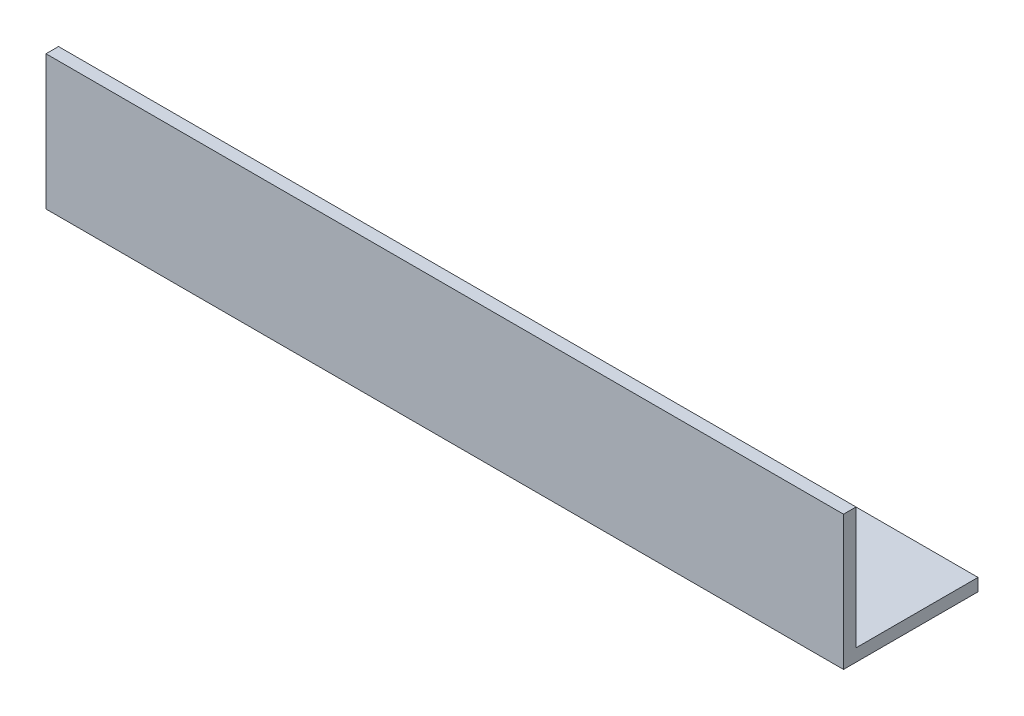
ISO-10303-21;
HEADER;
FILE_DESCRIPTION(('STEP AP214'),'2;1');
FILE_NAME('part.step','',(''),(''),'','','');
FILE_SCHEMA(('AUTOMOTIVE_DESIGN { 1 0 10303 214 1 1 1 1 }'));
ENDSEC;
DATA;
#1=APPLICATION_CONTEXT('core data for automotive mechanical design processes');
#2=APPLICATION_PROTOCOL_DEFINITION('international standard','automotive_design',2000,#1);
#3=PRODUCT_CONTEXT('',#1,'mechanical');
#4=PRODUCT('Part','Part','',(#3));
#5=PRODUCT_RELATED_PRODUCT_CATEGORY('part','',(#4));
#6=PRODUCT_DEFINITION_FORMATION('','',#4);
#7=PRODUCT_DEFINITION_CONTEXT('part definition',#1,'design');
#8=PRODUCT_DEFINITION('design','',#6,#7);
#9=PRODUCT_DEFINITION_SHAPE('','',#8);
#10=(LENGTH_UNIT() NAMED_UNIT(*) SI_UNIT(.MILLI.,.METRE.));
#11=(NAMED_UNIT(*) PLANE_ANGLE_UNIT() SI_UNIT($,.RADIAN.));
#12=(NAMED_UNIT(*) SI_UNIT($,.STERADIAN.) SOLID_ANGLE_UNIT());
#13=UNCERTAINTY_MEASURE_WITH_UNIT(LENGTH_MEASURE(1.E-05),#10,'distance_accuracy_value','');
#14=(GEOMETRIC_REPRESENTATION_CONTEXT(3) GLOBAL_UNCERTAINTY_ASSIGNED_CONTEXT((#13)) GLOBAL_UNIT_ASSIGNED_CONTEXT((#10,
#11,#12)) REPRESENTATION_CONTEXT('',''));
#15=CARTESIAN_POINT('',(0.,0.,0.));
#16=DIRECTION('',(0.,0.,1.));
#17=DIRECTION('',(1.,0.,0.));
#18=AXIS2_PLACEMENT_3D('',#15,#16,#17);
#19=CARTESIAN_POINT('',(255.,0.,0.));
#20=DIRECTION('',(0.,1.,0.));
#21=DIRECTION('',(0.,0.,1.));
#22=AXIS2_PLACEMENT_3D('',#19,#20,#21);
#23=PLANE('',#22);
#24=CARTESIAN_POINT('',(180.,0.,-23.));
#25=DIRECTION('',(0.,-1.,0.));
#26=DIRECTION('',(0.,0.,-1.));
#27=AXIS2_PLACEMENT_3D('',#24,#25,#26);
#28=CIRCLE('',#27,4.99999999999999);
#29=CARTESIAN_POINT('',(180.,0.,-28.));
#30=VERTEX_POINT('',#29);
#31=EDGE_CURVE('E143',#30,#30,#28,.T.);
#32=ORIENTED_EDGE('',*,*,#31,.F.);
#33=EDGE_LOOP('',(#32));
#34=FACE_BOUND('',#33,.T.);
#35=CARTESIAN_POINT('',(80.,0.,-23.));
#36=DIRECTION('',(0.,-1.,0.));
#37=DIRECTION('',(0.,0.,-1.));
#38=AXIS2_PLACEMENT_3D('',#35,#36,#37);
#39=CIRCLE('',#38,5.);
#40=CARTESIAN_POINT('',(80.,0.,-28.));
#41=VERTEX_POINT('',#40);
#42=EDGE_CURVE('E135',#41,#41,#39,.T.);
#43=ORIENTED_EDGE('',*,*,#42,.F.);
#44=EDGE_LOOP('',(#43));
#45=FACE_BOUND('',#44,.T.);
#46=DIRECTION('',(0.,0.,-1.));
#47=VECTOR('',#46,1.);
#48=CARTESIAN_POINT('',(0.,0.,0.));
#49=LINE('',#48,#47);
#50=CARTESIAN_POINT('',(0.,0.,0.));
#51=VERTEX_POINT('',#50);
#52=CARTESIAN_POINT('',(0.,0.,-43.));
#53=VERTEX_POINT('',#52);
#54=EDGE_CURVE('E117',#51,#53,#49,.T.);
#55=ORIENTED_EDGE('',*,*,#54,.T.);
#56=DIRECTION('',(-1.,0.,0.));
#57=VECTOR('',#56,1.);
#58=CARTESIAN_POINT('',(255.,0.,-43.));
#59=LINE('',#58,#57);
#60=CARTESIAN_POINT('',(255.,0.,-43.));
#61=VERTEX_POINT('',#60);
#62=EDGE_CURVE('E11',#61,#53,#59,.T.);
#63=ORIENTED_EDGE('',*,*,#62,.F.);
#64=DIRECTION('',(0.,0.,-1.));
#65=VECTOR('',#64,1.);
#66=CARTESIAN_POINT('',(255.,0.,0.));
#67=LINE('',#66,#65);
#68=CARTESIAN_POINT('',(255.,0.,0.));
#69=VERTEX_POINT('',#68);
#70=EDGE_CURVE('E82',#69,#61,#67,.T.);
#71=ORIENTED_EDGE('',*,*,#70,.F.);
#72=DIRECTION('',(-1.,0.,0.));
#73=VECTOR('',#72,1.);
#74=CARTESIAN_POINT('',(255.,0.,0.));
#75=LINE('',#74,#73);
#76=EDGE_CURVE('E113',#69,#51,#75,.T.);
#77=ORIENTED_EDGE('',*,*,#76,.T.);
#78=EDGE_LOOP('',(#55,#63,#71,#77));
#79=FACE_BOUND('',#78,.T.);
#80=ADVANCED_FACE('F34',(#34,#45,#79),#23,.F.);
#81=CARTESIAN_POINT('',(255.,4.,-43.));
#82=DIRECTION('',(0.,0.,-1.));
#83=DIRECTION('',(-1.,0.,0.));
#84=AXIS2_PLACEMENT_3D('',#81,#82,#83);
#85=PLANE('',#84);
#86=DIRECTION('',(0.,-1.,0.));
#87=VECTOR('',#86,1.);
#88=CARTESIAN_POINT('',(0.,4.,-43.));
#89=LINE('',#88,#87);
#90=CARTESIAN_POINT('',(0.,4.,-43.));
#91=VERTEX_POINT('',#90);
#92=EDGE_CURVE('E120',#91,#53,#89,.T.);
#93=ORIENTED_EDGE('',*,*,#92,.F.);
#94=DIRECTION('',(-1.,0.,0.));
#95=VECTOR('',#94,1.);
#96=CARTESIAN_POINT('',(255.,4.,-43.));
#97=LINE('',#96,#95);
#98=CARTESIAN_POINT('',(255.,4.,-43.));
#99=VERTEX_POINT('',#98);
#100=EDGE_CURVE('E43',#99,#91,#97,.T.);
#101=ORIENTED_EDGE('',*,*,#100,.F.);
#102=DIRECTION('',(0.,-1.,0.));
#103=VECTOR('',#102,1.);
#104=CARTESIAN_POINT('',(255.,4.,-43.));
#105=LINE('',#104,#103);
#106=EDGE_CURVE('E147',#99,#61,#105,.T.);
#107=ORIENTED_EDGE('',*,*,#106,.T.);
#108=ORIENTED_EDGE('',*,*,#62,.T.);
#109=EDGE_LOOP('',(#93,#101,#107,#108));
#110=FACE_BOUND('',#109,.T.);
#111=ADVANCED_FACE('F168',(#110),#85,.T.);
#112=CARTESIAN_POINT('',(255.,4.,0.));
#113=DIRECTION('',(0.,1.,0.));
#114=DIRECTION('',(0.,0.,1.));
#115=AXIS2_PLACEMENT_3D('',#112,#113,#114);
#116=PLANE('',#115);
#117=CARTESIAN_POINT('',(180.,4.,-23.));
#118=DIRECTION('',(0.,1.,0.));
#119=DIRECTION('',(0.,0.,1.));
#120=AXIS2_PLACEMENT_3D('',#117,#118,#119);
#121=CIRCLE('',#120,4.99999999999999);
#122=CARTESIAN_POINT('',(180.,4.,-18.));
#123=VERTEX_POINT('',#122);
#124=EDGE_CURVE('E37',#123,#123,#121,.T.);
#125=ORIENTED_EDGE('',*,*,#124,.F.);
#126=EDGE_LOOP('',(#125));
#127=FACE_BOUND('',#126,.T.);
#128=CARTESIAN_POINT('',(80.,4.,-23.));
#129=DIRECTION('',(0.,1.,0.));
#130=DIRECTION('',(0.,0.,1.));
#131=AXIS2_PLACEMENT_3D('',#128,#129,#130);
#132=CIRCLE('',#131,5.);
#133=CARTESIAN_POINT('',(80.,4.,-18.));
#134=VERTEX_POINT('',#133);
#135=EDGE_CURVE('E121',#134,#134,#132,.T.);
#136=ORIENTED_EDGE('',*,*,#135,.F.);
#137=EDGE_LOOP('',(#136));
#138=FACE_BOUND('',#137,.T.);
#139=DIRECTION('',(0.,0.,-1.));
#140=VECTOR('',#139,1.);
#141=CARTESIAN_POINT('',(0.,4.,0.));
#142=LINE('',#141,#140);
#143=CARTESIAN_POINT('',(0.,4.,-4.));
#144=VERTEX_POINT('',#143);
#145=EDGE_CURVE('E124',#144,#91,#142,.T.);
#146=ORIENTED_EDGE('',*,*,#145,.F.);
#147=DIRECTION('',(-1.,0.,0.));
#148=VECTOR('',#147,1.);
#149=CARTESIAN_POINT('',(255.,4.,-4.));
#150=LINE('',#149,#148);
#151=CARTESIAN_POINT('',(255.,4.,-4.));
#152=VERTEX_POINT('',#151);
#153=EDGE_CURVE('E103',#152,#144,#150,.T.);
#154=ORIENTED_EDGE('',*,*,#153,.F.);
#155=DIRECTION('',(0.,0.,-1.));
#156=VECTOR('',#155,1.);
#157=CARTESIAN_POINT('',(255.,4.,0.));
#158=LINE('',#157,#156);
#159=EDGE_CURVE('E109',#152,#99,#158,.T.);
#160=ORIENTED_EDGE('',*,*,#159,.T.);
#161=ORIENTED_EDGE('',*,*,#100,.T.);
#162=EDGE_LOOP('',(#146,#154,#160,#161));
#163=FACE_BOUND('',#162,.T.);
#164=ADVANCED_FACE('F151',(#127,#138,#163),#116,.T.);
#165=CARTESIAN_POINT('',(255.,43.,-4.));
#166=DIRECTION('',(0.,0.,-1.));
#167=DIRECTION('',(0.,1.,0.));
#168=AXIS2_PLACEMENT_3D('',#165,#166,#167);
#169=PLANE('',#168);
#170=DIRECTION('',(0.,-1.,0.));
#171=VECTOR('',#170,1.);
#172=CARTESIAN_POINT('',(0.,43.,-4.));
#173=LINE('',#172,#171);
#174=CARTESIAN_POINT('',(0.,43.,-4.));
#175=VERTEX_POINT('',#174);
#176=EDGE_CURVE('E98',#175,#144,#173,.T.);
#177=ORIENTED_EDGE('',*,*,#176,.F.);
#178=DIRECTION('',(-1.,0.,0.));
#179=VECTOR('',#178,1.);
#180=CARTESIAN_POINT('',(255.,43.,-4.));
#181=LINE('',#180,#179);
#182=CARTESIAN_POINT('',(255.,43.,-4.));
#183=VERTEX_POINT('',#182);
#184=EDGE_CURVE('E93',#183,#175,#181,.T.);
#185=ORIENTED_EDGE('',*,*,#184,.F.);
#186=DIRECTION('',(0.,-1.,0.));
#187=VECTOR('',#186,1.);
#188=CARTESIAN_POINT('',(255.,43.,-4.));
#189=LINE('',#188,#187);
#190=EDGE_CURVE('E96',#183,#152,#189,.T.);
#191=ORIENTED_EDGE('',*,*,#190,.T.);
#192=ORIENTED_EDGE('',*,*,#153,.T.);
#193=EDGE_LOOP('',(#177,#185,#191,#192));
#194=FACE_BOUND('',#193,.T.);
#195=ADVANCED_FACE('F95',(#194),#169,.T.);
#196=CARTESIAN_POINT('',(255.,43.,0.));
#197=DIRECTION('',(0.,1.,0.));
#198=DIRECTION('',(0.,0.,1.));
#199=AXIS2_PLACEMENT_3D('',#196,#197,#198);
#200=PLANE('',#199);
#201=DIRECTION('',(0.,0.,-1.));
#202=VECTOR('',#201,1.);
#203=CARTESIAN_POINT('',(0.,43.,0.));
#204=LINE('',#203,#202);
#205=CARTESIAN_POINT('',(0.,43.,0.));
#206=VERTEX_POINT('',#205);
#207=EDGE_CURVE('E128',#206,#175,#204,.T.);
#208=ORIENTED_EDGE('',*,*,#207,.F.);
#209=DIRECTION('',(-1.,0.,0.));
#210=VECTOR('',#209,1.);
#211=CARTESIAN_POINT('',(255.,43.,0.));
#212=LINE('',#211,#210);
#213=CARTESIAN_POINT('',(255.,43.,0.));
#214=VERTEX_POINT('',#213);
#215=EDGE_CURVE('E73',#214,#206,#212,.T.);
#216=ORIENTED_EDGE('',*,*,#215,.F.);
#217=DIRECTION('',(0.,0.,-1.));
#218=VECTOR('',#217,1.);
#219=CARTESIAN_POINT('',(255.,43.,0.));
#220=LINE('',#219,#218);
#221=EDGE_CURVE('E107',#214,#183,#220,.T.);
#222=ORIENTED_EDGE('',*,*,#221,.T.);
#223=ORIENTED_EDGE('',*,*,#184,.T.);
#224=EDGE_LOOP('',(#208,#216,#222,#223));
#225=FACE_BOUND('',#224,.T.);
#226=ADVANCED_FACE('F111',(#225),#200,.T.);
#227=CARTESIAN_POINT('',(255.,43.,0.));
#228=DIRECTION('',(0.,0.,-1.));
#229=DIRECTION('',(0.,1.,0.));
#230=AXIS2_PLACEMENT_3D('',#227,#228,#229);
#231=PLANE('',#230);
#232=DIRECTION('',(0.,-1.,0.));
#233=VECTOR('',#232,1.);
#234=CARTESIAN_POINT('',(0.,43.,0.));
#235=LINE('',#234,#233);
#236=EDGE_CURVE('E76',#206,#51,#235,.T.);
#237=ORIENTED_EDGE('',*,*,#236,.T.);
#238=ORIENTED_EDGE('',*,*,#76,.F.);
#239=DIRECTION('',(0.,-1.,0.));
#240=VECTOR('',#239,1.);
#241=CARTESIAN_POINT('',(255.,43.,0.));
#242=LINE('',#241,#240);
#243=EDGE_CURVE('E52',#214,#69,#242,.T.);
#244=ORIENTED_EDGE('',*,*,#243,.F.);
#245=ORIENTED_EDGE('',*,*,#215,.T.);
#246=EDGE_LOOP('',(#237,#238,#244,#245));
#247=FACE_BOUND('',#246,.T.);
#248=ADVANCED_FACE('F157',(#247),#231,.F.);
#249=CARTESIAN_POINT('',(255.,0.,0.));
#250=DIRECTION('',(-1.,0.,0.));
#251=DIRECTION('',(0.,0.,1.));
#252=AXIS2_PLACEMENT_3D('',#249,#250,#251);
#253=PLANE('',#252);
#254=ORIENTED_EDGE('',*,*,#70,.T.);
#255=ORIENTED_EDGE('',*,*,#106,.F.);
#256=ORIENTED_EDGE('',*,*,#159,.F.);
#257=ORIENTED_EDGE('',*,*,#190,.F.);
#258=ORIENTED_EDGE('',*,*,#221,.F.);
#259=ORIENTED_EDGE('',*,*,#243,.T.);
#260=EDGE_LOOP('',(#254,#255,#256,#257,#258,#259));
#261=FACE_BOUND('',#260,.T.);
#262=ADVANCED_FACE('F106',(#261),#253,.F.);
#263=CARTESIAN_POINT('',(0.,0.,0.));
#264=DIRECTION('',(-1.,0.,0.));
#265=DIRECTION('',(0.,0.,1.));
#266=AXIS2_PLACEMENT_3D('',#263,#264,#265);
#267=PLANE('',#266);
#268=ORIENTED_EDGE('',*,*,#54,.F.);
#269=ORIENTED_EDGE('',*,*,#236,.F.);
#270=ORIENTED_EDGE('',*,*,#207,.T.);
#271=ORIENTED_EDGE('',*,*,#176,.T.);
#272=ORIENTED_EDGE('',*,*,#145,.T.);
#273=ORIENTED_EDGE('',*,*,#92,.T.);
#274=EDGE_LOOP('',(#268,#269,#270,#271,#272,#273));
#275=FACE_BOUND('',#274,.T.);
#276=ADVANCED_FACE('F155',(#275),#267,.T.);
#277=CARTESIAN_POINT('',(80.,43.,-23.));
#278=DIRECTION('',(0.,-1.,0.));
#279=DIRECTION('',(0.,0.,-1.));
#280=AXIS2_PLACEMENT_3D('',#277,#278,#279);
#281=CYLINDRICAL_SURFACE('',#280,5.);
#282=ORIENTED_EDGE('',*,*,#135,.T.);
#283=EDGE_LOOP('',(#282));
#284=FACE_BOUND('',#283,.T.);
#285=ORIENTED_EDGE('',*,*,#42,.T.);
#286=EDGE_LOOP('',(#285));
#287=FACE_BOUND('',#286,.T.);
#288=ADVANCED_FACE('F180',(#284,#287),#281,.F.);
#289=CARTESIAN_POINT('',(180.,43.,-23.));
#290=DIRECTION('',(0.,-1.,0.));
#291=DIRECTION('',(0.,0.,-1.));
#292=AXIS2_PLACEMENT_3D('',#289,#290,#291);
#293=CYLINDRICAL_SURFACE('',#292,4.99999999999999);
#294=ORIENTED_EDGE('',*,*,#124,.T.);
#295=EDGE_LOOP('',(#294));
#296=FACE_BOUND('',#295,.T.);
#297=ORIENTED_EDGE('',*,*,#31,.T.);
#298=EDGE_LOOP('',(#297));
#299=FACE_BOUND('',#298,.T.);
#300=ADVANCED_FACE('F178',(#296,#299),#293,.F.);
#301=CLOSED_SHELL('',(#80,#111,#164,#195,#226,#248,#262,#276,#288,#300));
#302=MANIFOLD_SOLID_BREP('B2',#301);
#303=ADVANCED_BREP_SHAPE_REPRESENTATION('',(#18,#302),#14);
#304=SHAPE_DEFINITION_REPRESENTATION(#9,#303);
ENDSEC;
END-ISO-10303-21;
